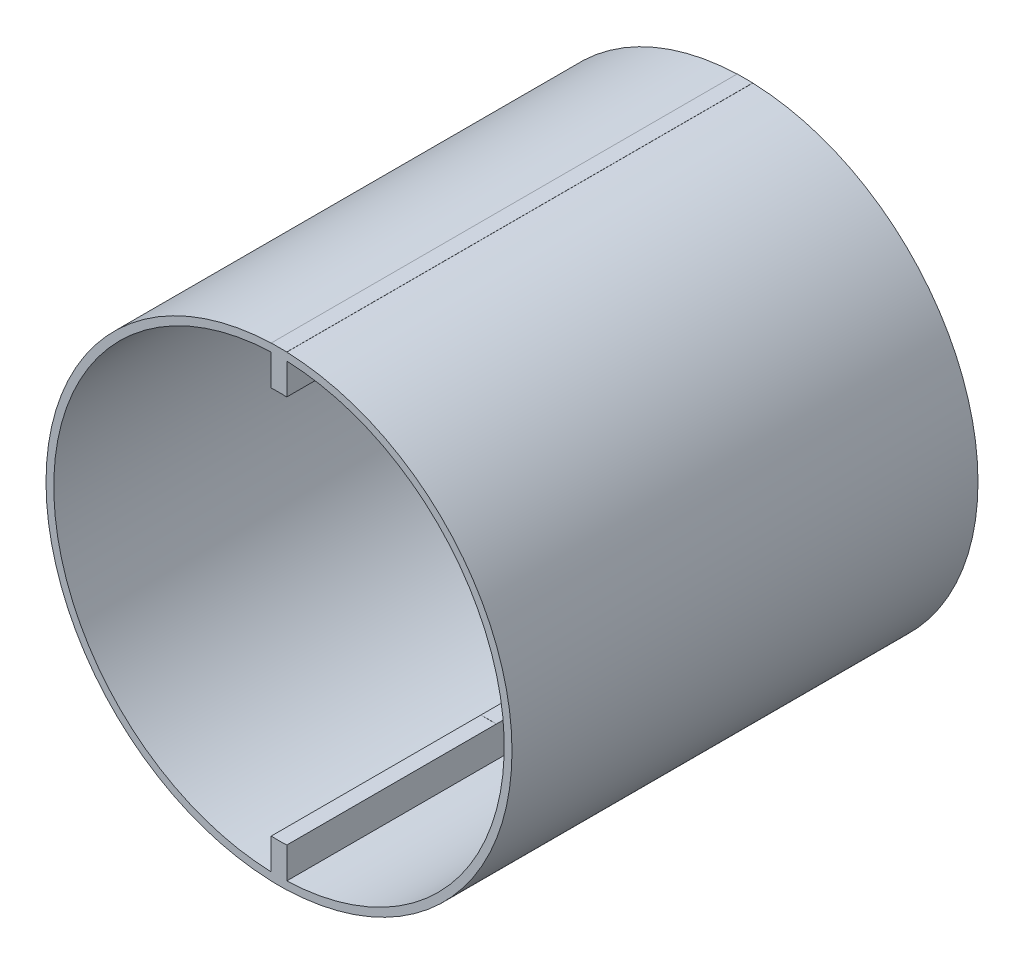
ISO-10303-21;
HEADER;
FILE_DESCRIPTION(('STEP AP214'),'2;1');
FILE_NAME('part.step','',(''),(''),'','','');
FILE_SCHEMA(('AUTOMOTIVE_DESIGN { 1 0 10303 214 1 1 1 1 }'));
ENDSEC;
DATA;
#1=APPLICATION_CONTEXT('core data for automotive mechanical design processes');
#2=APPLICATION_PROTOCOL_DEFINITION('international standard','automotive_design',2000,#1);
#3=PRODUCT_CONTEXT('',#1,'mechanical');
#4=PRODUCT('Part','Part','',(#3));
#5=PRODUCT_RELATED_PRODUCT_CATEGORY('part','',(#4));
#6=PRODUCT_DEFINITION_FORMATION('','',#4);
#7=PRODUCT_DEFINITION_CONTEXT('part definition',#1,'design');
#8=PRODUCT_DEFINITION('design','',#6,#7);
#9=PRODUCT_DEFINITION_SHAPE('','',#8);
#10=(LENGTH_UNIT() NAMED_UNIT(*) SI_UNIT(.MILLI.,.METRE.));
#11=(NAMED_UNIT(*) PLANE_ANGLE_UNIT() SI_UNIT($,.RADIAN.));
#12=(NAMED_UNIT(*) SI_UNIT($,.STERADIAN.) SOLID_ANGLE_UNIT());
#13=UNCERTAINTY_MEASURE_WITH_UNIT(LENGTH_MEASURE(1.E-05),#10,'distance_accuracy_value','');
#14=(GEOMETRIC_REPRESENTATION_CONTEXT(3) GLOBAL_UNCERTAINTY_ASSIGNED_CONTEXT((#13)) GLOBAL_UNIT_ASSIGNED_CONTEXT((#10,
#11,#12)) REPRESENTATION_CONTEXT('',''));
#15=CARTESIAN_POINT('',(0.,0.,0.));
#16=DIRECTION('',(0.,0.,1.));
#17=DIRECTION('',(1.,0.,0.));
#18=AXIS2_PLACEMENT_3D('',#15,#16,#17);
#19=CARTESIAN_POINT('',(0.,0.,33.));
#20=DIRECTION('',(0.,0.,1.));
#21=DIRECTION('',(1.,0.,0.));
#22=AXIS2_PLACEMENT_3D('',#19,#20,#21);
#23=PLANE('',#22);
#24=DIRECTION('',(-1.,0.,0.));
#25=VECTOR('',#24,1.);
#26=CARTESIAN_POINT('',(6.99999999999998,-24.9799919935936,33.));
#27=LINE('',#26,#25);
#28=CARTESIAN_POINT('',(0.999999999999961,-24.9799919935936,33.));
#29=VERTEX_POINT('',#28);
#30=CARTESIAN_POINT('',(-0.999999999999997,-24.9799919935936,33.));
#31=VERTEX_POINT('',#30);
#32=EDGE_CURVE('E401',#29,#31,#27,.T.);
#33=ORIENTED_EDGE('',*,*,#32,.T.);
#34=CARTESIAN_POINT('',(0.,0.,33.));
#35=DIRECTION('',(0.,0.,1.));
#36=DIRECTION('',(1.,0.,0.));
#37=AXIS2_PLACEMENT_3D('',#34,#35,#36);
#38=CIRCLE('',#37,25.);
#39=EDGE_CURVE('E389',#31,#29,#38,.T.);
#40=ORIENTED_EDGE('',*,*,#39,.T.);
#41=EDGE_LOOP('',(#33,#40));
#42=FACE_BOUND('',#41,.T.);
#43=ADVANCED_FACE('F35',(#42),#23,.T.);
#44=CARTESIAN_POINT('',(0.,0.,33.));
#45=DIRECTION('',(0.,0.,1.));
#46=DIRECTION('',(1.,0.,0.));
#47=AXIS2_PLACEMENT_3D('',#44,#45,#46);
#48=CIRCLE('',#47,2.225);
#49=CARTESIAN_POINT('',(2.225,0.,33.));
#50=VERTEX_POINT('',#49);
#51=EDGE_CURVE('E425',#50,#50,#48,.T.);
#52=ORIENTED_EDGE('',*,*,#51,.F.);
#53=EDGE_LOOP('',(#52));
#54=FACE_BOUND('',#53,.T.);
#55=DIRECTION('',(-1.,0.,0.));
#56=VECTOR('',#55,1.);
#57=CARTESIAN_POINT('',(6.99999999999998,-3.35410196624968,33.));
#58=LINE('',#57,#56);
#59=CARTESIAN_POINT('',(1.,-3.35410196624968,33.));
#60=VERTEX_POINT('',#59);
#61=CARTESIAN_POINT('',(-1.,-3.35410196624969,33.));
#62=VERTEX_POINT('',#61);
#63=EDGE_CURVE('E198',#60,#62,#58,.T.);
#64=ORIENTED_EDGE('',*,*,#63,.F.);
#65=CARTESIAN_POINT('',(0.,0.,33.));
#66=DIRECTION('',(0.,0.,1.));
#67=DIRECTION('',(1.,0.,0.));
#68=AXIS2_PLACEMENT_3D('',#65,#66,#67);
#69=CIRCLE('',#68,3.5);
#70=CARTESIAN_POINT('',(1.,3.35410196624969,33.));
#71=VERTEX_POINT('',#70);
#72=EDGE_CURVE('E43',#60,#71,#69,.T.);
#73=ORIENTED_EDGE('',*,*,#72,.T.);
#74=DIRECTION('',(-1.,0.,0.));
#75=VECTOR('',#74,1.);
#76=CARTESIAN_POINT('',(6.99999999999998,3.35410196624969,33.));
#77=LINE('',#76,#75);
#78=CARTESIAN_POINT('',(-1.,3.35410196624969,33.));
#79=VERTEX_POINT('',#78);
#80=EDGE_CURVE('E217',#71,#79,#77,.T.);
#81=ORIENTED_EDGE('',*,*,#80,.T.);
#82=CARTESIAN_POINT('',(0.,0.,33.));
#83=DIRECTION('',(0.,0.,1.));
#84=DIRECTION('',(1.,0.,0.));
#85=AXIS2_PLACEMENT_3D('',#82,#83,#84);
#86=CIRCLE('',#85,3.5);
#87=EDGE_CURVE('E215',#79,#62,#86,.T.);
#88=ORIENTED_EDGE('',*,*,#87,.T.);
#89=EDGE_LOOP('',(#64,#73,#81,#88));
#90=FACE_BOUND('',#89,.T.);
#91=ADVANCED_FACE('F216',(#54,#90),#23,.T.);
#92=CARTESIAN_POINT('',(0.,0.,60.));
#93=DIRECTION('',(0.,0.,-1.));
#94=DIRECTION('',(-1.,0.,0.));
#95=AXIS2_PLACEMENT_3D('',#92,#93,#94);
#96=CYLINDRICAL_SURFACE('',#95,3.5);
#97=ORIENTED_EDGE('',*,*,#87,.F.);
#98=DIRECTION('',(0.,0.,-1.));
#99=VECTOR('',#98,1.);
#100=CARTESIAN_POINT('',(-1.,3.35410196624968,60.));
#101=LINE('',#100,#99);
#102=CARTESIAN_POINT('',(-1.,3.35410196624969,16.));
#103=VERTEX_POINT('',#102);
#104=EDGE_CURVE('E289',#79,#103,#101,.T.);
#105=ORIENTED_EDGE('',*,*,#104,.T.);
#106=CARTESIAN_POINT('',(-1.,3.35410196624968,0.));
#107=VERTEX_POINT('',#106);
#108=EDGE_CURVE('E291',#103,#107,#101,.T.);
#109=ORIENTED_EDGE('',*,*,#108,.T.);
#110=CARTESIAN_POINT('',(0.,0.,0.));
#111=DIRECTION('',(0.,0.,1.));
#112=DIRECTION('',(1.,0.,0.));
#113=AXIS2_PLACEMENT_3D('',#110,#111,#112);
#114=CIRCLE('',#113,3.5);
#115=CARTESIAN_POINT('',(-1.,-3.35410196624968,0.));
#116=VERTEX_POINT('',#115);
#117=EDGE_CURVE('E326',#107,#116,#114,.T.);
#118=ORIENTED_EDGE('',*,*,#117,.T.);
#119=DIRECTION('',(0.,0.,-1.));
#120=VECTOR('',#119,1.);
#121=CARTESIAN_POINT('',(-1.,-3.35410196624968,60.));
#122=LINE('',#121,#120);
#123=CARTESIAN_POINT('',(-1.,-3.35410196624969,16.));
#124=VERTEX_POINT('',#123);
#125=EDGE_CURVE('E224',#124,#116,#122,.T.);
#126=ORIENTED_EDGE('',*,*,#125,.F.);
#127=EDGE_CURVE('E203',#62,#124,#122,.T.);
#128=ORIENTED_EDGE('',*,*,#127,.F.);
#129=EDGE_LOOP('',(#97,#105,#109,#118,#126,#128));
#130=FACE_BOUND('',#129,.T.);
#131=ADVANCED_FACE('F37',(#130),#96,.T.);
#132=CARTESIAN_POINT('',(0.,0.,60.));
#133=DIRECTION('',(0.,0.,-1.));
#134=DIRECTION('',(-1.,0.,0.));
#135=AXIS2_PLACEMENT_3D('',#132,#133,#134);
#136=CYLINDRICAL_SURFACE('',#135,3.5);
#137=ORIENTED_EDGE('',*,*,#72,.F.);
#138=DIRECTION('',(0.,0.,-1.));
#139=VECTOR('',#138,1.);
#140=CARTESIAN_POINT('',(1.,-3.35410196624968,60.));
#141=LINE('',#140,#139);
#142=CARTESIAN_POINT('',(1.,-3.35410196624969,16.));
#143=VERTEX_POINT('',#142);
#144=EDGE_CURVE('E206',#60,#143,#141,.T.);
#145=ORIENTED_EDGE('',*,*,#144,.T.);
#146=CARTESIAN_POINT('',(1.,-3.35410196624968,0.));
#147=VERTEX_POINT('',#146);
#148=EDGE_CURVE('E240',#143,#147,#141,.T.);
#149=ORIENTED_EDGE('',*,*,#148,.T.);
#150=CARTESIAN_POINT('',(0.,0.,0.));
#151=DIRECTION('',(0.,0.,1.));
#152=DIRECTION('',(1.,0.,0.));
#153=AXIS2_PLACEMENT_3D('',#150,#151,#152);
#154=CIRCLE('',#153,3.5);
#155=CARTESIAN_POINT('',(1.,3.35410196624968,0.));
#156=VERTEX_POINT('',#155);
#157=EDGE_CURVE('E278',#147,#156,#154,.T.);
#158=ORIENTED_EDGE('',*,*,#157,.T.);
#159=DIRECTION('',(0.,0.,-1.));
#160=VECTOR('',#159,1.);
#161=CARTESIAN_POINT('',(1.,3.35410196624968,60.));
#162=LINE('',#161,#160);
#163=CARTESIAN_POINT('',(1.,3.35410196624969,16.));
#164=VERTEX_POINT('',#163);
#165=EDGE_CURVE('E237',#164,#156,#162,.T.);
#166=ORIENTED_EDGE('',*,*,#165,.F.);
#167=EDGE_CURVE('E234',#71,#164,#162,.T.);
#168=ORIENTED_EDGE('',*,*,#167,.F.);
#169=EDGE_LOOP('',(#137,#145,#149,#158,#166,#168));
#170=FACE_BOUND('',#169,.T.);
#171=ADVANCED_FACE('F235',(#170),#136,.T.);
#172=CARTESIAN_POINT('',(-1.,-3.35410196624968,60.));
#173=DIRECTION('',(1.,0.,0.));
#174=DIRECTION('',(0.,1.,0.));
#175=AXIS2_PLACEMENT_3D('',#172,#173,#174);
#176=PLANE('',#175);
#177=DIRECTION('',(0.,0.,1.));
#178=VECTOR('',#177,1.);
#179=CARTESIAN_POINT('',(-0.999999999999997,-24.9799919935936,33.));
#180=LINE('',#179,#178);
#181=CARTESIAN_POINT('',(-0.999999999999997,-24.9799919935936,60.));
#182=VERTEX_POINT('',#181);
#183=EDGE_CURVE('E50',#182,#31,#180,.F.);
#184=ORIENTED_EDGE('',*,*,#183,.T.);
#185=DIRECTION('',(0.,0.,1.));
#186=VECTOR('',#185,1.);
#187=CARTESIAN_POINT('',(-0.999999999999997,-24.9799919935936,33.));
#188=LINE('',#187,#186);
#189=CARTESIAN_POINT('',(-0.999999999999997,-24.9799919935936,16.));
#190=VERTEX_POINT('',#189);
#191=EDGE_CURVE('E211',#190,#31,#188,.T.);
#192=ORIENTED_EDGE('',*,*,#191,.F.);
#193=DIRECTION('',(0.,-1.,0.));
#194=VECTOR('',#193,1.);
#195=CARTESIAN_POINT('',(-0.999999999999997,-24.9799919935936,16.));
#196=LINE('',#195,#194);
#197=EDGE_CURVE('E410',#124,#190,#196,.T.);
#198=ORIENTED_EDGE('',*,*,#197,.F.);
#199=ORIENTED_EDGE('',*,*,#125,.T.);
#200=DIRECTION('',(0.,-1.,0.));
#201=VECTOR('',#200,1.);
#202=CARTESIAN_POINT('',(-1.,-3.35410196624968,0.));
#203=LINE('',#202,#201);
#204=CARTESIAN_POINT('',(-0.999999999999997,-28.9827534923789,0.));
#205=VERTEX_POINT('',#204);
#206=EDGE_CURVE('E271',#116,#205,#203,.T.);
#207=ORIENTED_EDGE('',*,*,#206,.T.);
#208=DIRECTION('',(0.,0.,1.));
#209=VECTOR('',#208,1.);
#210=CARTESIAN_POINT('',(-0.999999999999997,-28.9827534923789,0.));
#211=LINE('',#210,#209);
#212=CARTESIAN_POINT('',(-0.999999999999997,-28.9827534923789,60.));
#213=VERTEX_POINT('',#212);
#214=EDGE_CURVE('E314',#213,#205,#211,.F.);
#215=ORIENTED_EDGE('',*,*,#214,.F.);
#216=DIRECTION('',(0.,-1.,0.));
#217=VECTOR('',#216,1.);
#218=CARTESIAN_POINT('',(-1.,-3.35410196624968,60.));
#219=LINE('',#218,#217);
#220=EDGE_CURVE('E327',#182,#213,#219,.T.);
#221=ORIENTED_EDGE('',*,*,#220,.F.);
#222=EDGE_LOOP('',(#184,#192,#198,#199,#207,#215,#221));
#223=FACE_BOUND('',#222,.T.);
#224=ADVANCED_FACE('F483',(#223),#176,.F.);
#225=CARTESIAN_POINT('',(1.,-15.0064685884307,60.));
#226=DIRECTION('',(-1.,0.,0.));
#227=DIRECTION('',(0.,0.,1.));
#228=AXIS2_PLACEMENT_3D('',#225,#226,#227);
#229=PLANE('',#228);
#230=DIRECTION('',(0.,-1.,0.));
#231=VECTOR('',#230,1.);
#232=CARTESIAN_POINT('',(1.,-15.0064685884307,16.));
#233=LINE('',#232,#231);
#234=CARTESIAN_POINT('',(1.,-24.9799919935936,16.));
#235=VERTEX_POINT('',#234);
#236=EDGE_CURVE('E11',#143,#235,#233,.T.);
#237=ORIENTED_EDGE('',*,*,#236,.T.);
#238=DIRECTION('',(0.,0.,1.));
#239=VECTOR('',#238,1.);
#240=CARTESIAN_POINT('',(1.,-24.9799919935936,60.));
#241=LINE('',#240,#239);
#242=EDGE_CURVE('E395',#235,#29,#241,.T.);
#243=ORIENTED_EDGE('',*,*,#242,.T.);
#244=DIRECTION('',(0.,0.,1.));
#245=VECTOR('',#244,1.);
#246=CARTESIAN_POINT('',(1.,-24.9799919935936,33.));
#247=LINE('',#246,#245);
#248=CARTESIAN_POINT('',(1.,-24.9799919935936,60.));
#249=VERTEX_POINT('',#248);
#250=EDGE_CURVE('E377',#29,#249,#247,.T.);
#251=ORIENTED_EDGE('',*,*,#250,.T.);
#252=DIRECTION('',(0.,1.,0.));
#253=VECTOR('',#252,1.);
#254=CARTESIAN_POINT('',(1.,-30.,60.));
#255=LINE('',#254,#253);
#256=CARTESIAN_POINT('',(1.,-28.9827534923789,60.));
#257=VERTEX_POINT('',#256);
#258=EDGE_CURVE('E330',#257,#249,#255,.T.);
#259=ORIENTED_EDGE('',*,*,#258,.F.);
#260=DIRECTION('',(0.,0.,1.));
#261=VECTOR('',#260,1.);
#262=CARTESIAN_POINT('',(1.,-28.9827534923789,0.));
#263=LINE('',#262,#261);
#264=CARTESIAN_POINT('',(1.,-28.9827534923789,0.));
#265=VERTEX_POINT('',#264);
#266=EDGE_CURVE('E319',#265,#257,#263,.T.);
#267=ORIENTED_EDGE('',*,*,#266,.F.);
#268=DIRECTION('',(0.,1.,0.));
#269=VECTOR('',#268,1.);
#270=CARTESIAN_POINT('',(1.,-15.0064685884307,0.));
#271=LINE('',#270,#269);
#272=EDGE_CURVE('E270',#265,#147,#271,.T.);
#273=ORIENTED_EDGE('',*,*,#272,.T.);
#274=ORIENTED_EDGE('',*,*,#148,.F.);
#275=EDGE_LOOP('',(#237,#243,#251,#259,#267,#273,#274));
#276=FACE_BOUND('',#275,.T.);
#277=ADVANCED_FACE('F472',(#276),#229,.F.);
#278=CARTESIAN_POINT('',(1.,3.35410196624968,60.));
#279=DIRECTION('',(-1.,0.,0.));
#280=DIRECTION('',(0.,0.,1.));
#281=AXIS2_PLACEMENT_3D('',#278,#279,#280);
#282=PLANE('',#281);
#283=DIRECTION('',(0.,0.,-1.));
#284=VECTOR('',#283,1.);
#285=CARTESIAN_POINT('',(1.,24.9799919935936,60.));
#286=LINE('',#285,#284);
#287=CARTESIAN_POINT('',(1.,24.9799919935936,33.));
#288=VERTEX_POINT('',#287);
#289=CARTESIAN_POINT('',(1.,24.9799919935936,16.));
#290=VERTEX_POINT('',#289);
#291=EDGE_CURVE('E398',#288,#290,#286,.T.);
#292=ORIENTED_EDGE('',*,*,#291,.T.);
#293=DIRECTION('',(0.,-1.,0.));
#294=VECTOR('',#293,1.);
#295=CARTESIAN_POINT('',(1.,3.35410196624968,16.));
#296=LINE('',#295,#294);
#297=EDGE_CURVE('E390',#290,#164,#296,.T.);
#298=ORIENTED_EDGE('',*,*,#297,.T.);
#299=ORIENTED_EDGE('',*,*,#165,.T.);
#300=DIRECTION('',(0.,1.,0.));
#301=VECTOR('',#300,1.);
#302=CARTESIAN_POINT('',(1.,3.35410196624968,0.));
#303=LINE('',#302,#301);
#304=CARTESIAN_POINT('',(1.,28.9827534923789,0.));
#305=VERTEX_POINT('',#304);
#306=EDGE_CURVE('E281',#156,#305,#303,.T.);
#307=ORIENTED_EDGE('',*,*,#306,.T.);
#308=DIRECTION('',(0.,0.,1.));
#309=VECTOR('',#308,1.);
#310=CARTESIAN_POINT('',(1.,28.9827534923789,0.));
#311=LINE('',#310,#309);
#312=CARTESIAN_POINT('',(1.,28.9827534923789,60.));
#313=VERTEX_POINT('',#312);
#314=EDGE_CURVE('E355',#313,#305,#311,.F.);
#315=ORIENTED_EDGE('',*,*,#314,.F.);
#316=DIRECTION('',(0.,1.,0.));
#317=VECTOR('',#316,1.);
#318=CARTESIAN_POINT('',(1.,3.35410196624968,60.));
#319=LINE('',#318,#317);
#320=CARTESIAN_POINT('',(1.,24.9799919935936,60.));
#321=VERTEX_POINT('',#320);
#322=EDGE_CURVE('E335',#321,#313,#319,.T.);
#323=ORIENTED_EDGE('',*,*,#322,.F.);
#324=DIRECTION('',(0.,0.,1.));
#325=VECTOR('',#324,1.);
#326=CARTESIAN_POINT('',(1.,24.9799919935936,33.));
#327=LINE('',#326,#325);
#328=EDGE_CURVE('E380',#321,#288,#327,.F.);
#329=ORIENTED_EDGE('',*,*,#328,.T.);
#330=EDGE_LOOP('',(#292,#298,#299,#307,#315,#323,#329));
#331=FACE_BOUND('',#330,.T.);
#332=ADVANCED_FACE('F467',(#331),#282,.F.);
#333=CARTESIAN_POINT('',(-1.,30.,60.));
#334=DIRECTION('',(1.,0.,0.));
#335=DIRECTION('',(0.,1.,0.));
#336=AXIS2_PLACEMENT_3D('',#333,#334,#335);
#337=PLANE('',#336);
#338=ORIENTED_EDGE('',*,*,#108,.F.);
#339=DIRECTION('',(0.,-1.,0.));
#340=VECTOR('',#339,1.);
#341=CARTESIAN_POINT('',(-1.,24.9799919935936,16.));
#342=LINE('',#341,#340);
#343=CARTESIAN_POINT('',(-1.,24.9799919935936,16.));
#344=VERTEX_POINT('',#343);
#345=EDGE_CURVE('E405',#344,#103,#342,.T.);
#346=ORIENTED_EDGE('',*,*,#345,.F.);
#347=DIRECTION('',(0.,0.,-1.));
#348=VECTOR('',#347,1.);
#349=CARTESIAN_POINT('',(-1.,24.9799919935936,33.));
#350=LINE('',#349,#348);
#351=CARTESIAN_POINT('',(-1.,24.9799919935936,33.));
#352=VERTEX_POINT('',#351);
#353=EDGE_CURVE('E413',#352,#344,#350,.T.);
#354=ORIENTED_EDGE('',*,*,#353,.F.);
#355=DIRECTION('',(0.,0.,1.));
#356=VECTOR('',#355,1.);
#357=CARTESIAN_POINT('',(-1.,24.9799919935936,33.));
#358=LINE('',#357,#356);
#359=CARTESIAN_POINT('',(-1.,24.9799919935936,60.));
#360=VERTEX_POINT('',#359);
#361=EDGE_CURVE('E383',#352,#360,#358,.T.);
#362=ORIENTED_EDGE('',*,*,#361,.T.);
#363=DIRECTION('',(0.,-1.,0.));
#364=VECTOR('',#363,1.);
#365=CARTESIAN_POINT('',(-1.,30.,60.));
#366=LINE('',#365,#364);
#367=CARTESIAN_POINT('',(-1.,28.9827534923789,60.));
#368=VERTEX_POINT('',#367);
#369=EDGE_CURVE('E338',#368,#360,#366,.T.);
#370=ORIENTED_EDGE('',*,*,#369,.F.);
#371=DIRECTION('',(0.,0.,1.));
#372=VECTOR('',#371,1.);
#373=CARTESIAN_POINT('',(-1.,28.9827534923789,0.));
#374=LINE('',#373,#372);
#375=CARTESIAN_POINT('',(-1.,28.9827534923789,0.));
#376=VERTEX_POINT('',#375);
#377=EDGE_CURVE('E352',#376,#368,#374,.T.);
#378=ORIENTED_EDGE('',*,*,#377,.F.);
#379=DIRECTION('',(0.,-1.,0.));
#380=VECTOR('',#379,1.);
#381=CARTESIAN_POINT('',(-1.,30.,0.));
#382=LINE('',#381,#380);
#383=EDGE_CURVE('E285',#376,#107,#382,.T.);
#384=ORIENTED_EDGE('',*,*,#383,.T.);
#385=EDGE_LOOP('',(#338,#346,#354,#362,#370,#378,#384));
#386=FACE_BOUND('',#385,.T.);
#387=ADVANCED_FACE('F494',(#386),#337,.F.);
#388=CARTESIAN_POINT('',(-0.999999999999997,-29.9833287011299,60.));
#389=VERTEX_POINT('',#388);
#390=CARTESIAN_POINT('',(-0.999999999999997,-30.,60.));
#391=VERTEX_POINT('',#390);
#392=EDGE_CURVE('E288',#389,#391,#219,.T.);
#393=ORIENTED_EDGE('',*,*,#392,.F.);
#394=DIRECTION('',(0.,0.,1.));
#395=VECTOR('',#394,1.);
#396=CARTESIAN_POINT('',(-0.999999999999997,-29.9833287011299,0.));
#397=LINE('',#396,#395);
#398=CARTESIAN_POINT('',(-0.999999999999997,-29.9833287011299,0.));
#399=VERTEX_POINT('',#398);
#400=EDGE_CURVE('E324',#389,#399,#397,.F.);
#401=ORIENTED_EDGE('',*,*,#400,.T.);
#402=CARTESIAN_POINT('',(-0.999999999999997,-30.,0.));
#403=VERTEX_POINT('',#402);
#404=EDGE_CURVE('E266',#399,#403,#203,.T.);
#405=ORIENTED_EDGE('',*,*,#404,.T.);
#406=DIRECTION('',(0.,0.,-1.));
#407=VECTOR('',#406,1.);
#408=CARTESIAN_POINT('',(-0.999999999999997,-30.,60.));
#409=LINE('',#408,#407);
#410=EDGE_CURVE('E228',#391,#403,#409,.T.);
#411=ORIENTED_EDGE('',*,*,#410,.F.);
#412=EDGE_LOOP('',(#393,#401,#405,#411));
#413=FACE_BOUND('',#412,.T.);
#414=ADVANCED_FACE('F341',(#413),#176,.F.);
#415=CARTESIAN_POINT('',(-0.999999999999997,-30.,60.));
#416=DIRECTION('',(0.,1.,0.));
#417=DIRECTION('',(0.,0.,1.));
#418=AXIS2_PLACEMENT_3D('',#415,#416,#417);
#419=PLANE('',#418);
#420=DIRECTION('',(1.,0.,0.));
#421=VECTOR('',#420,1.);
#422=CARTESIAN_POINT('',(-0.999999999999997,-30.,0.));
#423=LINE('',#422,#421);
#424=CARTESIAN_POINT('',(1.,-30.,0.));
#425=VERTEX_POINT('',#424);
#426=EDGE_CURVE('E257',#403,#425,#423,.T.);
#427=ORIENTED_EDGE('',*,*,#426,.T.);
#428=DIRECTION('',(0.,0.,-1.));
#429=VECTOR('',#428,1.);
#430=CARTESIAN_POINT('',(1.,-30.,60.));
#431=LINE('',#430,#429);
#432=CARTESIAN_POINT('',(1.,-30.,60.));
#433=VERTEX_POINT('',#432);
#434=EDGE_CURVE('E246',#433,#425,#431,.T.);
#435=ORIENTED_EDGE('',*,*,#434,.F.);
#436=DIRECTION('',(1.,0.,0.));
#437=VECTOR('',#436,1.);
#438=CARTESIAN_POINT('',(-0.999999999999997,-30.,60.));
#439=LINE('',#438,#437);
#440=EDGE_CURVE('E259',#391,#433,#439,.T.);
#441=ORIENTED_EDGE('',*,*,#440,.F.);
#442=ORIENTED_EDGE('',*,*,#410,.T.);
#443=EDGE_LOOP('',(#427,#435,#441,#442));
#444=FACE_BOUND('',#443,.T.);
#445=ADVANCED_FACE('F256',(#444),#419,.F.);
#446=CARTESIAN_POINT('',(1.,-29.9833287011299,0.));
#447=VERTEX_POINT('',#446);
#448=EDGE_CURVE('E269',#425,#447,#271,.T.);
#449=ORIENTED_EDGE('',*,*,#448,.T.);
#450=DIRECTION('',(0.,0.,1.));
#451=VECTOR('',#450,1.);
#452=CARTESIAN_POINT('',(1.,-29.9833287011299,0.));
#453=LINE('',#452,#451);
#454=CARTESIAN_POINT('',(1.,-29.9833287011299,60.));
#455=VERTEX_POINT('',#454);
#456=EDGE_CURVE('E316',#447,#455,#453,.T.);
#457=ORIENTED_EDGE('',*,*,#456,.T.);
#458=EDGE_CURVE('E331',#433,#455,#255,.T.);
#459=ORIENTED_EDGE('',*,*,#458,.F.);
#460=ORIENTED_EDGE('',*,*,#434,.T.);
#461=EDGE_LOOP('',(#449,#457,#459,#460));
#462=FACE_BOUND('',#461,.T.);
#463=ADVANCED_FACE('F512',(#462),#229,.F.);
#464=CARTESIAN_POINT('',(1.,29.9833287011299,60.));
#465=VERTEX_POINT('',#464);
#466=CARTESIAN_POINT('',(1.,30.,60.));
#467=VERTEX_POINT('',#466);
#468=EDGE_CURVE('E334',#465,#467,#319,.T.);
#469=ORIENTED_EDGE('',*,*,#468,.F.);
#470=DIRECTION('',(0.,0.,1.));
#471=VECTOR('',#470,1.);
#472=CARTESIAN_POINT('',(1.,29.9833287011299,0.));
#473=LINE('',#472,#471);
#474=CARTESIAN_POINT('',(1.,29.9833287011299,0.));
#475=VERTEX_POINT('',#474);
#476=EDGE_CURVE('E313',#465,#475,#473,.F.);
#477=ORIENTED_EDGE('',*,*,#476,.T.);
#478=CARTESIAN_POINT('',(1.,30.,0.));
#479=VERTEX_POINT('',#478);
#480=EDGE_CURVE('E280',#475,#479,#303,.T.);
#481=ORIENTED_EDGE('',*,*,#480,.T.);
#482=DIRECTION('',(0.,0.,-1.));
#483=VECTOR('',#482,1.);
#484=CARTESIAN_POINT('',(1.,30.,60.));
#485=LINE('',#484,#483);
#486=EDGE_CURVE('E243',#467,#479,#485,.T.);
#487=ORIENTED_EDGE('',*,*,#486,.F.);
#488=EDGE_LOOP('',(#469,#477,#481,#487));
#489=FACE_BOUND('',#488,.T.);
#490=ADVANCED_FACE('F509',(#489),#282,.F.);
#491=CARTESIAN_POINT('',(1.,30.,60.));
#492=DIRECTION('',(0.,-1.,0.));
#493=DIRECTION('',(0.,0.,-1.));
#494=AXIS2_PLACEMENT_3D('',#491,#492,#493);
#495=PLANE('',#494);
#496=DIRECTION('',(-1.,0.,0.));
#497=VECTOR('',#496,1.);
#498=CARTESIAN_POINT('',(1.,30.,0.));
#499=LINE('',#498,#497);
#500=CARTESIAN_POINT('',(-1.,30.,0.));
#501=VERTEX_POINT('',#500);
#502=EDGE_CURVE('E283',#479,#501,#499,.T.);
#503=ORIENTED_EDGE('',*,*,#502,.T.);
#504=DIRECTION('',(0.,0.,-1.));
#505=VECTOR('',#504,1.);
#506=CARTESIAN_POINT('',(-1.,30.,60.));
#507=LINE('',#506,#505);
#508=CARTESIAN_POINT('',(-1.,30.,60.));
#509=VERTEX_POINT('',#508);
#510=EDGE_CURVE('E290',#509,#501,#507,.T.);
#511=ORIENTED_EDGE('',*,*,#510,.F.);
#512=DIRECTION('',(-1.,0.,0.));
#513=VECTOR('',#512,1.);
#514=CARTESIAN_POINT('',(1.,30.,60.));
#515=LINE('',#514,#513);
#516=EDGE_CURVE('E301',#467,#509,#515,.T.);
#517=ORIENTED_EDGE('',*,*,#516,.F.);
#518=ORIENTED_EDGE('',*,*,#486,.T.);
#519=EDGE_LOOP('',(#503,#511,#517,#518));
#520=FACE_BOUND('',#519,.T.);
#521=ADVANCED_FACE('F300',(#520),#495,.F.);
#522=CARTESIAN_POINT('',(-1.,29.9833287011299,0.));
#523=VERTEX_POINT('',#522);
#524=EDGE_CURVE('E286',#501,#523,#382,.T.);
#525=ORIENTED_EDGE('',*,*,#524,.T.);
#526=DIRECTION('',(0.,0.,1.));
#527=VECTOR('',#526,1.);
#528=CARTESIAN_POINT('',(-1.,29.9833287011299,0.));
#529=LINE('',#528,#527);
#530=CARTESIAN_POINT('',(-1.,29.9833287011299,60.));
#531=VERTEX_POINT('',#530);
#532=EDGE_CURVE('E58',#523,#531,#529,.T.);
#533=ORIENTED_EDGE('',*,*,#532,.T.);
#534=EDGE_CURVE('E339',#509,#531,#366,.T.);
#535=ORIENTED_EDGE('',*,*,#534,.F.);
#536=ORIENTED_EDGE('',*,*,#510,.T.);
#537=EDGE_LOOP('',(#525,#533,#535,#536));
#538=FACE_BOUND('',#537,.T.);
#539=ADVANCED_FACE('F306',(#538),#337,.F.);
#540=CARTESIAN_POINT('',(0.,0.,60.));
#541=DIRECTION('',(0.,0.,1.));
#542=DIRECTION('',(1.,0.,0.));
#543=AXIS2_PLACEMENT_3D('',#540,#541,#542);
#544=PLANE('',#543);
#545=CARTESIAN_POINT('',(0.,0.,60.));
#546=DIRECTION('',(0.,0.,1.));
#547=DIRECTION('',(1.,0.,0.));
#548=AXIS2_PLACEMENT_3D('',#545,#546,#547);
#549=CIRCLE('',#548,25.);
#550=EDGE_CURVE('E387',#321,#360,#549,.T.);
#551=ORIENTED_EDGE('',*,*,#550,.F.);
#552=ORIENTED_EDGE('',*,*,#322,.T.);
#553=CARTESIAN_POINT('',(0.,0.,60.));
#554=DIRECTION('',(0.,0.,1.));
#555=DIRECTION('',(1.,0.,0.));
#556=AXIS2_PLACEMENT_3D('',#553,#554,#555);
#557=CIRCLE('',#556,29.);
#558=EDGE_CURVE('E220',#257,#313,#557,.T.);
#559=ORIENTED_EDGE('',*,*,#558,.F.);
#560=ORIENTED_EDGE('',*,*,#258,.T.);
#561=CARTESIAN_POINT('',(0.,0.,60.));
#562=DIRECTION('',(0.,0.,1.));
#563=DIRECTION('',(1.,0.,0.));
#564=AXIS2_PLACEMENT_3D('',#561,#562,#563);
#565=CIRCLE('',#564,25.);
#566=EDGE_CURVE('E225',#182,#249,#565,.T.);
#567=ORIENTED_EDGE('',*,*,#566,.F.);
#568=ORIENTED_EDGE('',*,*,#220,.T.);
#569=EDGE_CURVE('E372',#368,#213,#557,.T.);
#570=ORIENTED_EDGE('',*,*,#569,.F.);
#571=ORIENTED_EDGE('',*,*,#369,.T.);
#572=EDGE_LOOP('',(#551,#552,#559,#560,#567,#568,#570,#571));
#573=FACE_BOUND('',#572,.T.);
#574=CARTESIAN_POINT('',(0.,0.,60.));
#575=DIRECTION('',(0.,0.,1.));
#576=DIRECTION('',(1.,0.,0.));
#577=AXIS2_PLACEMENT_3D('',#574,#575,#576);
#578=CIRCLE('',#577,30.);
#579=EDGE_CURVE('E312',#531,#389,#578,.T.);
#580=ORIENTED_EDGE('',*,*,#579,.T.);
#581=ORIENTED_EDGE('',*,*,#392,.T.);
#582=ORIENTED_EDGE('',*,*,#440,.T.);
#583=ORIENTED_EDGE('',*,*,#458,.T.);
#584=EDGE_CURVE('E345',#455,#465,#578,.T.);
#585=ORIENTED_EDGE('',*,*,#584,.T.);
#586=ORIENTED_EDGE('',*,*,#468,.T.);
#587=ORIENTED_EDGE('',*,*,#516,.T.);
#588=ORIENTED_EDGE('',*,*,#534,.T.);
#589=EDGE_LOOP('',(#580,#581,#582,#583,#585,#586,#587,#588));
#590=FACE_BOUND('',#589,.T.);
#591=ADVANCED_FACE('F343',(#573,#590),#544,.T.);
#592=CARTESIAN_POINT('',(0.,0.,0.));
#593=DIRECTION('',(0.,0.,1.));
#594=DIRECTION('',(1.,0.,0.));
#595=AXIS2_PLACEMENT_3D('',#592,#593,#594);
#596=PLANE('',#595);
#597=ORIENTED_EDGE('',*,*,#404,.F.);
#598=CARTESIAN_POINT('',(0.,0.,0.));
#599=DIRECTION('',(0.,0.,1.));
#600=DIRECTION('',(1.,0.,0.));
#601=AXIS2_PLACEMENT_3D('',#598,#599,#600);
#602=CIRCLE('',#601,30.);
#603=EDGE_CURVE('E305',#523,#399,#602,.T.);
#604=ORIENTED_EDGE('',*,*,#603,.F.);
#605=ORIENTED_EDGE('',*,*,#524,.F.);
#606=ORIENTED_EDGE('',*,*,#502,.F.);
#607=ORIENTED_EDGE('',*,*,#480,.F.);
#608=EDGE_CURVE('E344',#447,#475,#602,.T.);
#609=ORIENTED_EDGE('',*,*,#608,.F.);
#610=ORIENTED_EDGE('',*,*,#448,.F.);
#611=ORIENTED_EDGE('',*,*,#426,.F.);
#612=EDGE_LOOP('',(#597,#604,#605,#606,#607,#609,#610,#611));
#613=FACE_BOUND('',#612,.T.);
#614=ORIENTED_EDGE('',*,*,#272,.F.);
#615=CARTESIAN_POINT('',(0.,0.,0.));
#616=DIRECTION('',(0.,0.,1.));
#617=DIRECTION('',(1.,0.,0.));
#618=AXIS2_PLACEMENT_3D('',#615,#616,#617);
#619=CIRCLE('',#618,29.);
#620=EDGE_CURVE('E364',#265,#305,#619,.T.);
#621=ORIENTED_EDGE('',*,*,#620,.T.);
#622=ORIENTED_EDGE('',*,*,#306,.F.);
#623=ORIENTED_EDGE('',*,*,#157,.F.);
#624=EDGE_LOOP('',(#614,#621,#622,#623));
#625=FACE_BOUND('',#624,.T.);
#626=EDGE_CURVE('E349',#376,#205,#619,.T.);
#627=ORIENTED_EDGE('',*,*,#626,.T.);
#628=ORIENTED_EDGE('',*,*,#206,.F.);
#629=ORIENTED_EDGE('',*,*,#117,.F.);
#630=ORIENTED_EDGE('',*,*,#383,.F.);
#631=EDGE_LOOP('',(#627,#628,#629,#630));
#632=FACE_BOUND('',#631,.T.);
#633=ADVANCED_FACE('F263',(#613,#625,#632),#596,.F.);
#634=CARTESIAN_POINT('',(0.,0.,0.));
#635=DIRECTION('',(0.,0.,1.));
#636=DIRECTION('',(1.,0.,0.));
#637=AXIS2_PLACEMENT_3D('',#634,#635,#636);
#638=CYLINDRICAL_SURFACE('',#637,29.);
#639=ORIENTED_EDGE('',*,*,#569,.T.);
#640=ORIENTED_EDGE('',*,*,#214,.T.);
#641=ORIENTED_EDGE('',*,*,#626,.F.);
#642=ORIENTED_EDGE('',*,*,#377,.T.);
#643=EDGE_LOOP('',(#639,#640,#641,#642));
#644=FACE_BOUND('',#643,.T.);
#645=ADVANCED_FACE('F459',(#644),#638,.F.);
#646=CARTESIAN_POINT('',(0.,0.,0.));
#647=DIRECTION('',(0.,0.,1.));
#648=DIRECTION('',(1.,0.,0.));
#649=AXIS2_PLACEMENT_3D('',#646,#647,#648);
#650=CYLINDRICAL_SURFACE('',#649,30.);
#651=ORIENTED_EDGE('',*,*,#400,.F.);
#652=ORIENTED_EDGE('',*,*,#579,.F.);
#653=ORIENTED_EDGE('',*,*,#532,.F.);
#654=ORIENTED_EDGE('',*,*,#603,.T.);
#655=EDGE_LOOP('',(#651,#652,#653,#654));
#656=FACE_BOUND('',#655,.T.);
#657=ADVANCED_FACE('F310',(#656),#650,.T.);
#658=ORIENTED_EDGE('',*,*,#456,.F.);
#659=ORIENTED_EDGE('',*,*,#608,.T.);
#660=ORIENTED_EDGE('',*,*,#476,.F.);
#661=ORIENTED_EDGE('',*,*,#584,.F.);
#662=EDGE_LOOP('',(#658,#659,#660,#661));
#663=FACE_BOUND('',#662,.T.);
#664=ADVANCED_FACE('F457',(#663),#650,.T.);
#665=ORIENTED_EDGE('',*,*,#620,.F.);
#666=ORIENTED_EDGE('',*,*,#266,.T.);
#667=ORIENTED_EDGE('',*,*,#558,.T.);
#668=ORIENTED_EDGE('',*,*,#314,.T.);
#669=EDGE_LOOP('',(#665,#666,#667,#668));
#670=FACE_BOUND('',#669,.T.);
#671=ADVANCED_FACE('F362',(#670),#638,.F.);
#672=DIRECTION('',(-1.,0.,0.));
#673=VECTOR('',#672,1.);
#674=CARTESIAN_POINT('',(6.99999999999998,24.9799919935936,33.));
#675=LINE('',#674,#673);
#676=EDGE_CURVE('E402',#288,#352,#675,.T.);
#677=ORIENTED_EDGE('',*,*,#676,.F.);
#678=EDGE_CURVE('E386',#288,#352,#38,.T.);
#679=ORIENTED_EDGE('',*,*,#678,.T.);
#680=EDGE_LOOP('',(#677,#679));
#681=FACE_BOUND('',#680,.T.);
#682=ADVANCED_FACE('F441',(#681),#23,.T.);
#683=CARTESIAN_POINT('',(0.,0.,33.));
#684=DIRECTION('',(0.,0.,1.));
#685=DIRECTION('',(1.,0.,0.));
#686=AXIS2_PLACEMENT_3D('',#683,#684,#685);
#687=CYLINDRICAL_SURFACE('',#686,25.);
#688=ORIENTED_EDGE('',*,*,#566,.T.);
#689=ORIENTED_EDGE('',*,*,#250,.F.);
#690=ORIENTED_EDGE('',*,*,#39,.F.);
#691=ORIENTED_EDGE('',*,*,#183,.F.);
#692=EDGE_LOOP('',(#688,#689,#690,#691));
#693=FACE_BOUND('',#692,.T.);
#694=ADVANCED_FACE('F450',(#693),#687,.F.);
#695=ORIENTED_EDGE('',*,*,#550,.T.);
#696=ORIENTED_EDGE('',*,*,#361,.F.);
#697=ORIENTED_EDGE('',*,*,#678,.F.);
#698=ORIENTED_EDGE('',*,*,#328,.F.);
#699=EDGE_LOOP('',(#695,#696,#697,#698));
#700=FACE_BOUND('',#699,.T.);
#701=ADVANCED_FACE('F456',(#700),#687,.F.);
#702=CARTESIAN_POINT('',(6.99999999999998,24.9799919935936,16.));
#703=DIRECTION('',(0.,0.,-1.));
#704=DIRECTION('',(-1.,0.,0.));
#705=AXIS2_PLACEMENT_3D('',#702,#703,#704);
#706=PLANE('',#705);
#707=DIRECTION('',(-1.,0.,0.));
#708=VECTOR('',#707,1.);
#709=CARTESIAN_POINT('',(6.99999999999998,24.9799919935936,16.));
#710=LINE('',#709,#708);
#711=EDGE_CURVE('E404',#290,#344,#710,.T.);
#712=ORIENTED_EDGE('',*,*,#711,.T.);
#713=ORIENTED_EDGE('',*,*,#345,.T.);
#714=DIRECTION('',(-1.,0.,0.));
#715=VECTOR('',#714,1.);
#716=CARTESIAN_POINT('',(6.99999999999998,3.35410196624969,16.));
#717=LINE('',#716,#715);
#718=EDGE_CURVE('E407',#164,#103,#717,.T.);
#719=ORIENTED_EDGE('',*,*,#718,.F.);
#720=ORIENTED_EDGE('',*,*,#297,.F.);
#721=EDGE_LOOP('',(#712,#713,#719,#720));
#722=FACE_BOUND('',#721,.T.);
#723=ADVANCED_FACE('F556',(#722),#706,.F.);
#724=CARTESIAN_POINT('',(6.99999999999998,3.35410196624969,33.));
#725=DIRECTION('',(0.,-1.,0.));
#726=DIRECTION('',(1.,0.,0.));
#727=AXIS2_PLACEMENT_3D('',#724,#725,#726);
#728=PLANE('',#727);
#729=ORIENTED_EDGE('',*,*,#718,.T.);
#730=ORIENTED_EDGE('',*,*,#104,.F.);
#731=ORIENTED_EDGE('',*,*,#80,.F.);
#732=ORIENTED_EDGE('',*,*,#167,.T.);
#733=EDGE_LOOP('',(#729,#730,#731,#732));
#734=FACE_BOUND('',#733,.T.);
#735=ADVANCED_FACE('F565',(#734),#728,.F.);
#736=CARTESIAN_POINT('',(6.99999999999998,24.9799919935936,33.));
#737=DIRECTION('',(0.,1.,0.));
#738=DIRECTION('',(0.,0.,1.));
#739=AXIS2_PLACEMENT_3D('',#736,#737,#738);
#740=PLANE('',#739);
#741=ORIENTED_EDGE('',*,*,#676,.T.);
#742=ORIENTED_EDGE('',*,*,#353,.T.);
#743=ORIENTED_EDGE('',*,*,#711,.F.);
#744=ORIENTED_EDGE('',*,*,#291,.F.);
#745=EDGE_LOOP('',(#741,#742,#743,#744));
#746=FACE_BOUND('',#745,.T.);
#747=ADVANCED_FACE('F576',(#746),#740,.F.);
#748=CARTESIAN_POINT('',(6.99999999999998,-24.9799919935936,16.));
#749=DIRECTION('',(0.,0.,-1.));
#750=DIRECTION('',(-1.,0.,0.));
#751=AXIS2_PLACEMENT_3D('',#748,#749,#750);
#752=PLANE('',#751);
#753=DIRECTION('',(-1.,0.,0.));
#754=VECTOR('',#753,1.);
#755=CARTESIAN_POINT('',(6.99999999999998,-3.35410196624968,16.));
#756=LINE('',#755,#754);
#757=EDGE_CURVE('E210',#143,#124,#756,.T.);
#758=ORIENTED_EDGE('',*,*,#757,.T.);
#759=ORIENTED_EDGE('',*,*,#197,.T.);
#760=DIRECTION('',(-1.,0.,0.));
#761=VECTOR('',#760,1.);
#762=CARTESIAN_POINT('',(6.99999999999998,-24.9799919935936,16.));
#763=LINE('',#762,#761);
#764=EDGE_CURVE('E418',#235,#190,#763,.T.);
#765=ORIENTED_EDGE('',*,*,#764,.F.);
#766=ORIENTED_EDGE('',*,*,#236,.F.);
#767=EDGE_LOOP('',(#758,#759,#765,#766));
#768=FACE_BOUND('',#767,.T.);
#769=ADVANCED_FACE('F476',(#768),#752,.F.);
#770=CARTESIAN_POINT('',(6.99999999999998,-24.9799919935936,33.));
#771=DIRECTION('',(0.,-1.,0.));
#772=DIRECTION('',(0.,0.,-1.));
#773=AXIS2_PLACEMENT_3D('',#770,#771,#772);
#774=PLANE('',#773);
#775=ORIENTED_EDGE('',*,*,#764,.T.);
#776=ORIENTED_EDGE('',*,*,#191,.T.);
#777=ORIENTED_EDGE('',*,*,#32,.F.);
#778=ORIENTED_EDGE('',*,*,#242,.F.);
#779=EDGE_LOOP('',(#775,#776,#777,#778));
#780=FACE_BOUND('',#779,.T.);
#781=ADVANCED_FACE('F479',(#780),#774,.F.);
#782=CARTESIAN_POINT('',(6.99999999999998,-3.35410196624968,33.));
#783=DIRECTION('',(0.,1.,0.));
#784=DIRECTION('',(-1.,0.,0.));
#785=AXIS2_PLACEMENT_3D('',#782,#783,#784);
#786=PLANE('',#785);
#787=ORIENTED_EDGE('',*,*,#63,.T.);
#788=ORIENTED_EDGE('',*,*,#127,.T.);
#789=ORIENTED_EDGE('',*,*,#757,.F.);
#790=ORIENTED_EDGE('',*,*,#144,.F.);
#791=EDGE_LOOP('',(#787,#788,#789,#790));
#792=FACE_BOUND('',#791,.T.);
#793=ADVANCED_FACE('F200',(#792),#786,.F.);
#794=CARTESIAN_POINT('',(0.,0.,31.));
#795=DIRECTION('',(0.,0.,1.));
#796=DIRECTION('',(1.,0.,0.));
#797=AXIS2_PLACEMENT_3D('',#794,#795,#796);
#798=CYLINDRICAL_SURFACE('',#797,2.225);
#799=CARTESIAN_POINT('',(0.,0.,31.));
#800=DIRECTION('',(0.,0.,1.));
#801=DIRECTION('',(1.,0.,0.));
#802=AXIS2_PLACEMENT_3D('',#799,#800,#801);
#803=CIRCLE('',#802,2.225);
#804=CARTESIAN_POINT('',(2.225,0.,31.));
#805=VERTEX_POINT('',#804);
#806=EDGE_CURVE('E415',#805,#805,#803,.T.);
#807=ORIENTED_EDGE('',*,*,#806,.F.);
#808=EDGE_LOOP('',(#807));
#809=FACE_BOUND('',#808,.T.);
#810=ORIENTED_EDGE('',*,*,#51,.T.);
#811=EDGE_LOOP('',(#810));
#812=FACE_BOUND('',#811,.T.);
#813=ADVANCED_FACE('F433',(#809,#812),#798,.F.);
#814=CARTESIAN_POINT('',(0.,0.,31.));
#815=DIRECTION('',(0.,0.,1.));
#816=DIRECTION('',(1.,0.,0.));
#817=AXIS2_PLACEMENT_3D('',#814,#815,#816);
#818=PLANE('',#817);
#819=ORIENTED_EDGE('',*,*,#806,.T.);
#820=EDGE_LOOP('',(#819));
#821=FACE_BOUND('',#820,.T.);
#822=ADVANCED_FACE('F431',(#821),#818,.T.);
#823=CLOSED_SHELL('',(#43,#91,#131,#171,#224,#277,#332,#387,#414,#445,#463,#490,#521,#539,#591,
#633,#645,#657,#664,#671,#682,#694,#701,#723,#735,#747,#769,#781,#793,#813,#822));
#824=MANIFOLD_SOLID_BREP('B2',#823);
#825=ADVANCED_BREP_SHAPE_REPRESENTATION('',(#18,#824),#14);
#826=SHAPE_DEFINITION_REPRESENTATION(#9,#825);
ENDSEC;
END-ISO-10303-21;
